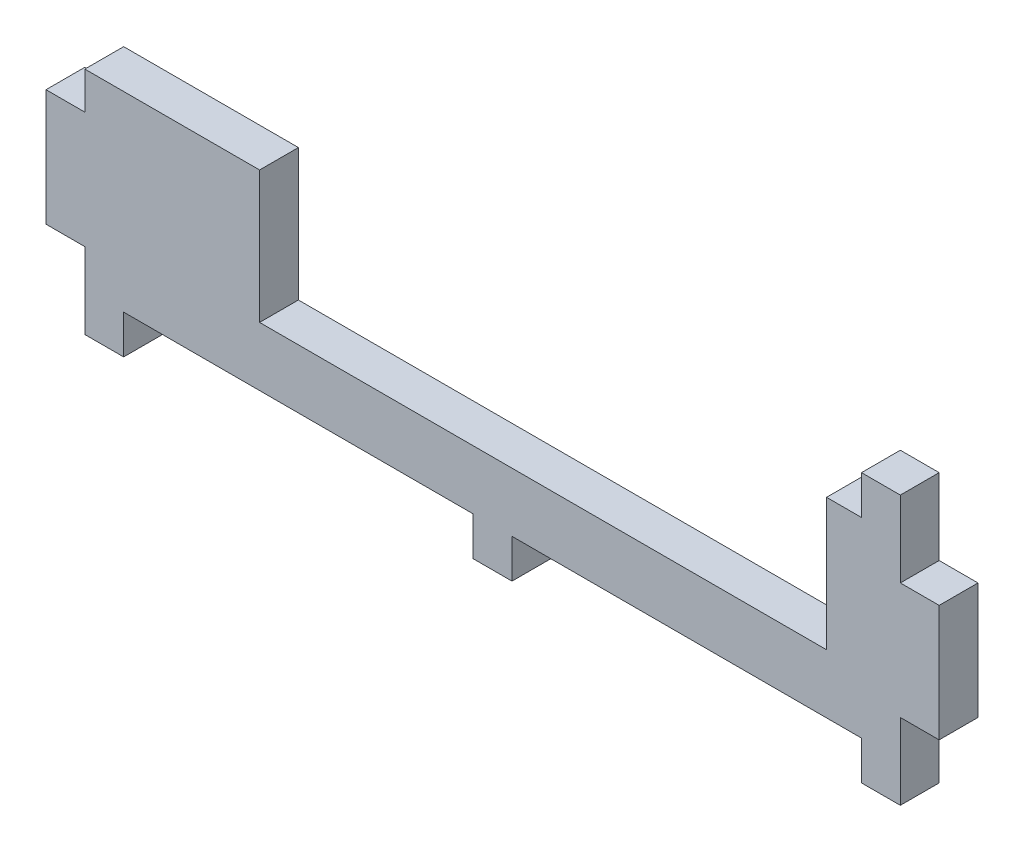
ISO-10303-21;
HEADER;
FILE_DESCRIPTION(('STEP AP214'),'2;1');
FILE_NAME('part.step','',(''),(''),'','','');
FILE_SCHEMA(('AUTOMOTIVE_DESIGN { 1 0 10303 214 1 1 1 1 }'));
ENDSEC;
DATA;
#1=APPLICATION_CONTEXT('core data for automotive mechanical design processes');
#2=APPLICATION_PROTOCOL_DEFINITION('international standard','automotive_design',2000,#1);
#3=PRODUCT_CONTEXT('',#1,'mechanical');
#4=PRODUCT('Part','Part','',(#3));
#5=PRODUCT_RELATED_PRODUCT_CATEGORY('part','',(#4));
#6=PRODUCT_DEFINITION_FORMATION('','',#4);
#7=PRODUCT_DEFINITION_CONTEXT('part definition',#1,'design');
#8=PRODUCT_DEFINITION('design','',#6,#7);
#9=PRODUCT_DEFINITION_SHAPE('','',#8);
#10=(LENGTH_UNIT() NAMED_UNIT(*) SI_UNIT(.MILLI.,.METRE.));
#11=(NAMED_UNIT(*) PLANE_ANGLE_UNIT() SI_UNIT($,.RADIAN.));
#12=(NAMED_UNIT(*) SI_UNIT($,.STERADIAN.) SOLID_ANGLE_UNIT());
#13=UNCERTAINTY_MEASURE_WITH_UNIT(LENGTH_MEASURE(1.E-05),#10,'distance_accuracy_value','');
#14=(GEOMETRIC_REPRESENTATION_CONTEXT(3) GLOBAL_UNCERTAINTY_ASSIGNED_CONTEXT((#13)) GLOBAL_UNIT_ASSIGNED_CONTEXT((#10,
#11,#12)) REPRESENTATION_CONTEXT('',''));
#15=CARTESIAN_POINT('',(0.,0.,0.));
#16=DIRECTION('',(0.,0.,1.));
#17=DIRECTION('',(1.,0.,0.));
#18=AXIS2_PLACEMENT_3D('',#15,#16,#17);
#19=CARTESIAN_POINT('',(52.5,-6.15,5.));
#20=DIRECTION('',(-1.,0.,0.));
#21=DIRECTION('',(0.,0.,1.));
#22=AXIS2_PLACEMENT_3D('',#19,#20,#21);
#23=PLANE('',#22);
#24=DIRECTION('',(0.,1.,0.));
#25=VECTOR('',#24,1.);
#26=CARTESIAN_POINT('',(52.5,-6.15,0.));
#27=LINE('',#26,#25);
#28=CARTESIAN_POINT('',(52.5,-11.15,0.));
#29=VERTEX_POINT('',#28);
#30=CARTESIAN_POINT('',(52.5,-1.35,0.));
#31=VERTEX_POINT('',#30);
#32=EDGE_CURVE('E258',#29,#31,#27,.T.);
#33=ORIENTED_EDGE('',*,*,#32,.T.);
#34=DIRECTION('',(0.,0.,1.));
#35=VECTOR('',#34,1.);
#36=CARTESIAN_POINT('',(52.5,-1.35,0.));
#37=LINE('',#36,#35);
#38=CARTESIAN_POINT('',(52.5,-1.35,5.));
#39=VERTEX_POINT('',#38);
#40=EDGE_CURVE('E226',#31,#39,#37,.T.);
#41=ORIENTED_EDGE('',*,*,#40,.T.);
#42=DIRECTION('',(0.,1.,0.));
#43=VECTOR('',#42,1.);
#44=CARTESIAN_POINT('',(52.5,-6.15,5.));
#45=LINE('',#44,#43);
#46=CARTESIAN_POINT('',(52.5,-11.15,5.));
#47=VERTEX_POINT('',#46);
#48=EDGE_CURVE('E456',#47,#39,#45,.T.);
#49=ORIENTED_EDGE('',*,*,#48,.F.);
#50=DIRECTION('',(0.,0.,1.));
#51=VECTOR('',#50,1.);
#52=CARTESIAN_POINT('',(52.5,-11.15,5.));
#53=LINE('',#52,#51);
#54=EDGE_CURVE('E266',#29,#47,#53,.T.);
#55=ORIENTED_EDGE('',*,*,#54,.F.);
#56=EDGE_LOOP('',(#33,#41,#49,#55));
#57=FACE_BOUND('',#56,.T.);
#58=ADVANCED_FACE('F33',(#57),#23,.F.);
#59=CARTESIAN_POINT('',(-52.5,-6.15,5.));
#60=DIRECTION('',(1.,0.,0.));
#61=DIRECTION('',(0.,0.,-1.));
#62=AXIS2_PLACEMENT_3D('',#59,#60,#61);
#63=PLANE('',#62);
#64=DIRECTION('',(0.,0.,-1.));
#65=VECTOR('',#64,1.);
#66=CARTESIAN_POINT('',(-52.5,13.65,0.));
#67=LINE('',#66,#65);
#68=CARTESIAN_POINT('',(-52.5,13.65,5.));
#69=VERTEX_POINT('',#68);
#70=CARTESIAN_POINT('',(-52.5,13.65,0.));
#71=VERTEX_POINT('',#70);
#72=EDGE_CURVE('E58',#69,#71,#67,.T.);
#73=ORIENTED_EDGE('',*,*,#72,.F.);
#74=DIRECTION('',(0.,-1.,0.));
#75=VECTOR('',#74,1.);
#76=CARTESIAN_POINT('',(-52.5,-6.15,5.));
#77=LINE('',#76,#75);
#78=CARTESIAN_POINT('',(-52.5,18.45,5.));
#79=VERTEX_POINT('',#78);
#80=EDGE_CURVE('E295',#79,#69,#77,.T.);
#81=ORIENTED_EDGE('',*,*,#80,.F.);
#82=DIRECTION('',(0.,0.,-1.));
#83=VECTOR('',#82,1.);
#84=CARTESIAN_POINT('',(-52.5,18.45,5.));
#85=LINE('',#84,#83);
#86=CARTESIAN_POINT('',(-52.5,18.45,0.));
#87=VERTEX_POINT('',#86);
#88=EDGE_CURVE('E316',#79,#87,#85,.T.);
#89=ORIENTED_EDGE('',*,*,#88,.T.);
#90=DIRECTION('',(0.,-1.,0.));
#91=VECTOR('',#90,1.);
#92=CARTESIAN_POINT('',(-52.5,-6.15,0.));
#93=LINE('',#92,#91);
#94=EDGE_CURVE('E269',#87,#71,#93,.T.);
#95=ORIENTED_EDGE('',*,*,#94,.T.);
#96=EDGE_LOOP('',(#73,#81,#89,#95));
#97=FACE_BOUND('',#96,.T.);
#98=ADVANCED_FACE('F452',(#97),#63,.F.);
#99=DIRECTION('',(0.,0.,1.));
#100=VECTOR('',#99,1.);
#101=CARTESIAN_POINT('',(-52.5,-1.35,0.));
#102=LINE('',#101,#100);
#103=CARTESIAN_POINT('',(-52.5,-1.35,0.));
#104=VERTEX_POINT('',#103);
#105=CARTESIAN_POINT('',(-52.5,-1.35,5.));
#106=VERTEX_POINT('',#105);
#107=EDGE_CURVE('E215',#104,#106,#102,.T.);
#108=ORIENTED_EDGE('',*,*,#107,.F.);
#109=CARTESIAN_POINT('',(-52.5,-11.15,0.));
#110=VERTEX_POINT('',#109);
#111=EDGE_CURVE('E267',#104,#110,#93,.T.);
#112=ORIENTED_EDGE('',*,*,#111,.T.);
#113=DIRECTION('',(0.,0.,-1.));
#114=VECTOR('',#113,1.);
#115=CARTESIAN_POINT('',(-52.5,-11.15,5.));
#116=LINE('',#115,#114);
#117=CARTESIAN_POINT('',(-52.5,-11.15,5.));
#118=VERTEX_POINT('',#117);
#119=EDGE_CURVE('E473',#118,#110,#116,.T.);
#120=ORIENTED_EDGE('',*,*,#119,.F.);
#121=EDGE_CURVE('E455',#106,#118,#77,.T.);
#122=ORIENTED_EDGE('',*,*,#121,.F.);
#123=EDGE_LOOP('',(#108,#112,#120,#122));
#124=FACE_BOUND('',#123,.T.);
#125=ADVANCED_FACE('F553',(#124),#63,.F.);
#126=CARTESIAN_POINT('',(-52.5,-6.15,5.));
#127=DIRECTION('',(0.,1.,0.));
#128=DIRECTION('',(0.,0.,1.));
#129=AXIS2_PLACEMENT_3D('',#126,#127,#128);
#130=PLANE('',#129);
#131=DIRECTION('',(0.,0.,1.));
#132=VECTOR('',#131,1.);
#133=CARTESIAN_POINT('',(-47.5,-6.15,5.));
#134=LINE('',#133,#132);
#135=CARTESIAN_POINT('',(-47.5,-6.15,0.));
#136=VERTEX_POINT('',#135);
#137=CARTESIAN_POINT('',(-47.5,-6.15,5.));
#138=VERTEX_POINT('',#137);
#139=EDGE_CURVE('E493',#136,#138,#134,.T.);
#140=ORIENTED_EDGE('',*,*,#139,.F.);
#141=DIRECTION('',(1.,0.,0.));
#142=VECTOR('',#141,1.);
#143=CARTESIAN_POINT('',(-52.5,-6.15,0.));
#144=LINE('',#143,#142);
#145=CARTESIAN_POINT('',(-2.5,-6.15,0.));
#146=VERTEX_POINT('',#145);
#147=EDGE_CURVE('E292',#136,#146,#144,.T.);
#148=ORIENTED_EDGE('',*,*,#147,.T.);
#149=DIRECTION('',(0.,0.,-1.));
#150=VECTOR('',#149,1.);
#151=CARTESIAN_POINT('',(-2.5,-6.15,5.));
#152=LINE('',#151,#150);
#153=CARTESIAN_POINT('',(-2.5,-6.15,5.));
#154=VERTEX_POINT('',#153);
#155=EDGE_CURVE('E370',#154,#146,#152,.T.);
#156=ORIENTED_EDGE('',*,*,#155,.F.);
#157=DIRECTION('',(1.,0.,0.));
#158=VECTOR('',#157,1.);
#159=CARTESIAN_POINT('',(-52.5,-6.15,5.));
#160=LINE('',#159,#158);
#161=EDGE_CURVE('E11',#138,#154,#160,.T.);
#162=ORIENTED_EDGE('',*,*,#161,.F.);
#163=EDGE_LOOP('',(#140,#148,#156,#162));
#164=FACE_BOUND('',#163,.T.);
#165=ADVANCED_FACE('F532',(#164),#130,.F.);
#166=DIRECTION('',(0.,0.,1.));
#167=VECTOR('',#166,1.);
#168=CARTESIAN_POINT('',(2.5,-6.15,5.));
#169=LINE('',#168,#167);
#170=CARTESIAN_POINT('',(2.50000000000001,-6.15,0.));
#171=VERTEX_POINT('',#170);
#172=CARTESIAN_POINT('',(2.50000000000001,-6.15,5.));
#173=VERTEX_POINT('',#172);
#174=EDGE_CURVE('E364',#171,#173,#169,.T.);
#175=ORIENTED_EDGE('',*,*,#174,.F.);
#176=CARTESIAN_POINT('',(47.5,-6.15,0.));
#177=VERTEX_POINT('',#176);
#178=EDGE_CURVE('E290',#171,#177,#144,.T.);
#179=ORIENTED_EDGE('',*,*,#178,.T.);
#180=DIRECTION('',(0.,0.,-1.));
#181=VECTOR('',#180,1.);
#182=CARTESIAN_POINT('',(47.5,-6.15,5.));
#183=LINE('',#182,#181);
#184=CARTESIAN_POINT('',(47.5,-6.15,5.));
#185=VERTEX_POINT('',#184);
#186=EDGE_CURVE('E337',#185,#177,#183,.T.);
#187=ORIENTED_EDGE('',*,*,#186,.F.);
#188=EDGE_CURVE('E42',#173,#185,#160,.T.);
#189=ORIENTED_EDGE('',*,*,#188,.F.);
#190=EDGE_LOOP('',(#175,#179,#187,#189));
#191=FACE_BOUND('',#190,.T.);
#192=ADVANCED_FACE('F362',(#191),#130,.F.);
#193=CARTESIAN_POINT('',(-52.5,18.45,5.));
#194=DIRECTION('',(0.,-1.,0.));
#195=DIRECTION('',(0.,0.,1.));
#196=AXIS2_PLACEMENT_3D('',#193,#194,#195);
#197=PLANE('',#196);
#198=DIRECTION('',(1.,0.,0.));
#199=VECTOR('',#198,1.);
#200=CARTESIAN_POINT('',(-52.5,18.45,5.));
#201=LINE('',#200,#199);
#202=CARTESIAN_POINT('',(-30.,18.45,5.));
#203=VERTEX_POINT('',#202);
#204=EDGE_CURVE('E300',#79,#203,#201,.T.);
#205=ORIENTED_EDGE('',*,*,#204,.T.);
#206=DIRECTION('',(0.,0.,1.));
#207=VECTOR('',#206,1.);
#208=CARTESIAN_POINT('',(-30.,18.45,0.));
#209=LINE('',#208,#207);
#210=CARTESIAN_POINT('',(-30.,18.45,0.));
#211=VERTEX_POINT('',#210);
#212=EDGE_CURVE('E380',#211,#203,#209,.T.);
#213=ORIENTED_EDGE('',*,*,#212,.F.);
#214=DIRECTION('',(1.,0.,0.));
#215=VECTOR('',#214,1.);
#216=CARTESIAN_POINT('',(-52.5,18.45,0.));
#217=LINE('',#216,#215);
#218=EDGE_CURVE('E301',#87,#211,#217,.T.);
#219=ORIENTED_EDGE('',*,*,#218,.F.);
#220=ORIENTED_EDGE('',*,*,#88,.F.);
#221=EDGE_LOOP('',(#205,#213,#219,#220));
#222=FACE_BOUND('',#221,.T.);
#223=ADVANCED_FACE('F448',(#222),#197,.F.);
#224=CARTESIAN_POINT('',(52.5,13.65,5.));
#225=VERTEX_POINT('',#224);
#226=CARTESIAN_POINT('',(52.5,23.45,5.));
#227=VERTEX_POINT('',#226);
#228=EDGE_CURVE('E242',#225,#227,#45,.T.);
#229=ORIENTED_EDGE('',*,*,#228,.F.);
#230=DIRECTION('',(0.,0.,-1.));
#231=VECTOR('',#230,1.);
#232=CARTESIAN_POINT('',(52.5,13.65,0.));
#233=LINE('',#232,#231);
#234=CARTESIAN_POINT('',(52.5,13.65,0.));
#235=VERTEX_POINT('',#234);
#236=EDGE_CURVE('E240',#225,#235,#233,.T.);
#237=ORIENTED_EDGE('',*,*,#236,.T.);
#238=CARTESIAN_POINT('',(52.5,23.45,0.));
#239=VERTEX_POINT('',#238);
#240=EDGE_CURVE('E214',#235,#239,#27,.T.);
#241=ORIENTED_EDGE('',*,*,#240,.T.);
#242=DIRECTION('',(0.,0.,1.));
#243=VECTOR('',#242,1.);
#244=CARTESIAN_POINT('',(52.5,23.45,5.));
#245=LINE('',#244,#243);
#246=EDGE_CURVE('E413',#239,#227,#245,.T.);
#247=ORIENTED_EDGE('',*,*,#246,.T.);
#248=EDGE_LOOP('',(#229,#237,#241,#247));
#249=FACE_BOUND('',#248,.T.);
#250=ADVANCED_FACE('F35',(#249),#23,.F.);
#251=CARTESIAN_POINT('',(0.,0.,5.));
#252=DIRECTION('',(0.,0.,-1.));
#253=DIRECTION('',(-1.,0.,0.));
#254=AXIS2_PLACEMENT_3D('',#251,#252,#253);
#255=PLANE('',#254);
#256=DIRECTION('',(1.,0.,0.));
#257=VECTOR('',#256,1.);
#258=CARTESIAN_POINT('',(-30.,1.45,5.));
#259=LINE('',#258,#257);
#260=CARTESIAN_POINT('',(-30.,1.45,5.));
#261=VERTEX_POINT('',#260);
#262=CARTESIAN_POINT('',(43.,1.45,5.));
#263=VERTEX_POINT('',#262);
#264=EDGE_CURVE('E389',#261,#263,#259,.T.);
#265=ORIENTED_EDGE('',*,*,#264,.F.);
#266=DIRECTION('',(0.,1.,0.));
#267=VECTOR('',#266,1.);
#268=CARTESIAN_POINT('',(-30.,1.45,5.));
#269=LINE('',#268,#267);
#270=EDGE_CURVE('E399',#261,#203,#269,.T.);
#271=ORIENTED_EDGE('',*,*,#270,.T.);
#272=ORIENTED_EDGE('',*,*,#204,.F.);
#273=ORIENTED_EDGE('',*,*,#80,.T.);
#274=DIRECTION('',(1.,0.,0.));
#275=VECTOR('',#274,1.);
#276=CARTESIAN_POINT('',(-57.5,13.65,5.));
#277=LINE('',#276,#275);
#278=CARTESIAN_POINT('',(-57.5,13.65,5.));
#279=VERTEX_POINT('',#278);
#280=EDGE_CURVE('E484',#279,#69,#277,.T.);
#281=ORIENTED_EDGE('',*,*,#280,.F.);
#282=DIRECTION('',(0.,1.,0.));
#283=VECTOR('',#282,1.);
#284=CARTESIAN_POINT('',(-57.5,13.65,5.));
#285=LINE('',#284,#283);
#286=CARTESIAN_POINT('',(-57.5,-1.35,5.));
#287=VERTEX_POINT('',#286);
#288=EDGE_CURVE('E848',#287,#279,#285,.T.);
#289=ORIENTED_EDGE('',*,*,#288,.F.);
#290=DIRECTION('',(1.,0.,0.));
#291=VECTOR('',#290,1.);
#292=CARTESIAN_POINT('',(-57.5,-1.35,5.));
#293=LINE('',#292,#291);
#294=EDGE_CURVE('E464',#287,#106,#293,.T.);
#295=ORIENTED_EDGE('',*,*,#294,.T.);
#296=ORIENTED_EDGE('',*,*,#121,.T.);
#297=DIRECTION('',(-1.,0.,0.));
#298=VECTOR('',#297,1.);
#299=CARTESIAN_POINT('',(-52.5,-11.15,5.));
#300=LINE('',#299,#298);
#301=CARTESIAN_POINT('',(-47.5,-11.15,5.));
#302=VERTEX_POINT('',#301);
#303=EDGE_CURVE('E508',#302,#118,#300,.T.);
#304=ORIENTED_EDGE('',*,*,#303,.F.);
#305=DIRECTION('',(0.,1.,0.));
#306=VECTOR('',#305,1.);
#307=CARTESIAN_POINT('',(-47.5,-11.15,5.));
#308=LINE('',#307,#306);
#309=EDGE_CURVE('E510',#302,#138,#308,.T.);
#310=ORIENTED_EDGE('',*,*,#309,.T.);
#311=ORIENTED_EDGE('',*,*,#161,.T.);
#312=DIRECTION('',(0.,1.,0.));
#313=VECTOR('',#312,1.);
#314=CARTESIAN_POINT('',(-2.5,-11.15,5.));
#315=LINE('',#314,#313);
#316=CARTESIAN_POINT('',(-2.5,-11.15,5.));
#317=VERTEX_POINT('',#316);
#318=EDGE_CURVE('E382',#317,#154,#315,.T.);
#319=ORIENTED_EDGE('',*,*,#318,.F.);
#320=DIRECTION('',(-1.,0.,0.));
#321=VECTOR('',#320,1.);
#322=CARTESIAN_POINT('',(-2.5,-11.15,5.));
#323=LINE('',#322,#321);
#324=CARTESIAN_POINT('',(2.5,-11.15,5.));
#325=VERTEX_POINT('',#324);
#326=EDGE_CURVE('E519',#325,#317,#323,.T.);
#327=ORIENTED_EDGE('',*,*,#326,.F.);
#328=DIRECTION('',(0.,1.,0.));
#329=VECTOR('',#328,1.);
#330=CARTESIAN_POINT('',(2.5,-11.15,5.));
#331=LINE('',#330,#329);
#332=EDGE_CURVE('E377',#325,#173,#331,.T.);
#333=ORIENTED_EDGE('',*,*,#332,.T.);
#334=ORIENTED_EDGE('',*,*,#188,.T.);
#335=DIRECTION('',(0.,1.,0.));
#336=VECTOR('',#335,1.);
#337=CARTESIAN_POINT('',(47.5,-11.15,5.));
#338=LINE('',#337,#336);
#339=CARTESIAN_POINT('',(47.5,-11.15,5.));
#340=VERTEX_POINT('',#339);
#341=EDGE_CURVE('E342',#340,#185,#338,.T.);
#342=ORIENTED_EDGE('',*,*,#341,.F.);
#343=DIRECTION('',(-1.,0.,0.));
#344=VECTOR('',#343,1.);
#345=CARTESIAN_POINT('',(47.5,-11.15,5.));
#346=LINE('',#345,#344);
#347=EDGE_CURVE('E340',#47,#340,#346,.T.);
#348=ORIENTED_EDGE('',*,*,#347,.F.);
#349=ORIENTED_EDGE('',*,*,#48,.T.);
#350=DIRECTION('',(-1.,0.,0.));
#351=VECTOR('',#350,1.);
#352=CARTESIAN_POINT('',(57.5,-1.35,5.));
#353=LINE('',#352,#351);
#354=CARTESIAN_POINT('',(57.5,-1.35,5.));
#355=VERTEX_POINT('',#354);
#356=EDGE_CURVE('E249',#355,#39,#353,.T.);
#357=ORIENTED_EDGE('',*,*,#356,.F.);
#358=DIRECTION('',(0.,1.,0.));
#359=VECTOR('',#358,1.);
#360=CARTESIAN_POINT('',(57.5,13.65,5.));
#361=LINE('',#360,#359);
#362=CARTESIAN_POINT('',(57.5,13.65,5.));
#363=VERTEX_POINT('',#362);
#364=EDGE_CURVE('E229',#355,#363,#361,.T.);
#365=ORIENTED_EDGE('',*,*,#364,.T.);
#366=DIRECTION('',(-1.,0.,0.));
#367=VECTOR('',#366,1.);
#368=CARTESIAN_POINT('',(57.5,13.65,5.));
#369=LINE('',#368,#367);
#370=EDGE_CURVE('E216',#363,#225,#369,.T.);
#371=ORIENTED_EDGE('',*,*,#370,.T.);
#372=ORIENTED_EDGE('',*,*,#228,.T.);
#373=DIRECTION('',(-1.,0.,0.));
#374=VECTOR('',#373,1.);
#375=CARTESIAN_POINT('',(47.5,23.45,5.));
#376=LINE('',#375,#374);
#377=CARTESIAN_POINT('',(47.5,23.45,5.));
#378=VERTEX_POINT('',#377);
#379=EDGE_CURVE('E330',#227,#378,#376,.T.);
#380=ORIENTED_EDGE('',*,*,#379,.T.);
#381=DIRECTION('',(0.,-1.,0.));
#382=VECTOR('',#381,1.);
#383=CARTESIAN_POINT('',(47.5,23.45,5.));
#384=LINE('',#383,#382);
#385=CARTESIAN_POINT('',(47.5,18.45,5.));
#386=VERTEX_POINT('',#385);
#387=EDGE_CURVE('E320',#378,#386,#384,.T.);
#388=ORIENTED_EDGE('',*,*,#387,.T.);
#389=CARTESIAN_POINT('',(43.,18.45,5.));
#390=VERTEX_POINT('',#389);
#391=EDGE_CURVE('E297',#390,#386,#201,.T.);
#392=ORIENTED_EDGE('',*,*,#391,.F.);
#393=DIRECTION('',(0.,1.,0.));
#394=VECTOR('',#393,1.);
#395=CARTESIAN_POINT('',(43.,1.45,5.));
#396=LINE('',#395,#394);
#397=EDGE_CURVE('E406',#263,#390,#396,.T.);
#398=ORIENTED_EDGE('',*,*,#397,.F.);
#399=EDGE_LOOP('',(#265,#271,#272,#273,#281,#289,#295,#296,#304,#310,#311,#319,#327,#333,#334,
#342,#348,#349,#357,#365,#371,#372,#380,#388,#392,#398));
#400=FACE_BOUND('',#399,.T.);
#401=ADVANCED_FACE('F419',(#400),#255,.F.);
#402=CARTESIAN_POINT('',(0.,0.,0.));
#403=DIRECTION('',(0.,0.,-1.));
#404=DIRECTION('',(-1.,0.,0.));
#405=AXIS2_PLACEMENT_3D('',#402,#403,#404);
#406=PLANE('',#405);
#407=DIRECTION('',(0.,1.,0.));
#408=VECTOR('',#407,1.);
#409=CARTESIAN_POINT('',(-30.,1.45,0.));
#410=LINE('',#409,#408);
#411=CARTESIAN_POINT('',(-30.,1.45,0.));
#412=VERTEX_POINT('',#411);
#413=EDGE_CURVE('E327',#412,#211,#410,.T.);
#414=ORIENTED_EDGE('',*,*,#413,.F.);
#415=DIRECTION('',(-1.,0.,0.));
#416=VECTOR('',#415,1.);
#417=CARTESIAN_POINT('',(-30.,1.45,0.));
#418=LINE('',#417,#416);
#419=CARTESIAN_POINT('',(43.,1.45,0.));
#420=VERTEX_POINT('',#419);
#421=EDGE_CURVE('E396',#420,#412,#418,.T.);
#422=ORIENTED_EDGE('',*,*,#421,.F.);
#423=DIRECTION('',(0.,1.,0.));
#424=VECTOR('',#423,1.);
#425=CARTESIAN_POINT('',(43.,1.45,0.));
#426=LINE('',#425,#424);
#427=CARTESIAN_POINT('',(43.,18.45,0.));
#428=VERTEX_POINT('',#427);
#429=EDGE_CURVE('E403',#420,#428,#426,.T.);
#430=ORIENTED_EDGE('',*,*,#429,.T.);
#431=CARTESIAN_POINT('',(47.5,18.45,0.));
#432=VERTEX_POINT('',#431);
#433=EDGE_CURVE('E302',#428,#432,#217,.T.);
#434=ORIENTED_EDGE('',*,*,#433,.T.);
#435=DIRECTION('',(0.,-1.,0.));
#436=VECTOR('',#435,1.);
#437=CARTESIAN_POINT('',(47.5,23.45,0.));
#438=LINE('',#437,#436);
#439=CARTESIAN_POINT('',(47.5,23.45,0.));
#440=VERTEX_POINT('',#439);
#441=EDGE_CURVE('E317',#440,#432,#438,.T.);
#442=ORIENTED_EDGE('',*,*,#441,.F.);
#443=DIRECTION('',(1.,0.,0.));
#444=VECTOR('',#443,1.);
#445=CARTESIAN_POINT('',(47.5,23.45,0.));
#446=LINE('',#445,#444);
#447=EDGE_CURVE('E411',#440,#239,#446,.T.);
#448=ORIENTED_EDGE('',*,*,#447,.T.);
#449=ORIENTED_EDGE('',*,*,#240,.F.);
#450=DIRECTION('',(-1.,0.,0.));
#451=VECTOR('',#450,1.);
#452=CARTESIAN_POINT('',(57.5,13.65,0.));
#453=LINE('',#452,#451);
#454=CARTESIAN_POINT('',(57.5,13.65,0.));
#455=VERTEX_POINT('',#454);
#456=EDGE_CURVE('E50',#455,#235,#453,.T.);
#457=ORIENTED_EDGE('',*,*,#456,.F.);
#458=DIRECTION('',(0.,-1.,0.));
#459=VECTOR('',#458,1.);
#460=CARTESIAN_POINT('',(57.5,13.65,0.));
#461=LINE('',#460,#459);
#462=CARTESIAN_POINT('',(57.5,-1.35,0.));
#463=VERTEX_POINT('',#462);
#464=EDGE_CURVE('E211',#455,#463,#461,.T.);
#465=ORIENTED_EDGE('',*,*,#464,.T.);
#466=DIRECTION('',(-1.,0.,0.));
#467=VECTOR('',#466,1.);
#468=CARTESIAN_POINT('',(57.5,-1.35,0.));
#469=LINE('',#468,#467);
#470=EDGE_CURVE('E234',#463,#31,#469,.T.);
#471=ORIENTED_EDGE('',*,*,#470,.T.);
#472=ORIENTED_EDGE('',*,*,#32,.F.);
#473=DIRECTION('',(1.,0.,0.));
#474=VECTOR('',#473,1.);
#475=CARTESIAN_POINT('',(47.5,-11.15,0.));
#476=LINE('',#475,#474);
#477=CARTESIAN_POINT('',(47.5,-11.15,0.));
#478=VERTEX_POINT('',#477);
#479=EDGE_CURVE('E336',#478,#29,#476,.T.);
#480=ORIENTED_EDGE('',*,*,#479,.F.);
#481=DIRECTION('',(0.,1.,0.));
#482=VECTOR('',#481,1.);
#483=CARTESIAN_POINT('',(47.5,-11.15,0.));
#484=LINE('',#483,#482);
#485=EDGE_CURVE('E271',#478,#177,#484,.T.);
#486=ORIENTED_EDGE('',*,*,#485,.T.);
#487=ORIENTED_EDGE('',*,*,#178,.F.);
#488=DIRECTION('',(0.,1.,0.));
#489=VECTOR('',#488,1.);
#490=CARTESIAN_POINT('',(2.50000000000001,-11.15,0.));
#491=LINE('',#490,#489);
#492=CARTESIAN_POINT('',(2.50000000000001,-11.15,0.));
#493=VERTEX_POINT('',#492);
#494=EDGE_CURVE('E373',#493,#171,#491,.T.);
#495=ORIENTED_EDGE('',*,*,#494,.F.);
#496=DIRECTION('',(1.,0.,0.));
#497=VECTOR('',#496,1.);
#498=CARTESIAN_POINT('',(-2.5,-11.15,0.));
#499=LINE('',#498,#497);
#500=CARTESIAN_POINT('',(-2.5,-11.15,0.));
#501=VERTEX_POINT('',#500);
#502=EDGE_CURVE('E516',#501,#493,#499,.T.);
#503=ORIENTED_EDGE('',*,*,#502,.F.);
#504=DIRECTION('',(0.,1.,0.));
#505=VECTOR('',#504,1.);
#506=CARTESIAN_POINT('',(-2.5,-11.15,0.));
#507=LINE('',#506,#505);
#508=EDGE_CURVE('E376',#501,#146,#507,.T.);
#509=ORIENTED_EDGE('',*,*,#508,.T.);
#510=ORIENTED_EDGE('',*,*,#147,.F.);
#511=DIRECTION('',(0.,1.,0.));
#512=VECTOR('',#511,1.);
#513=CARTESIAN_POINT('',(-47.5,-11.15,0.));
#514=LINE('',#513,#512);
#515=CARTESIAN_POINT('',(-47.5,-11.15,0.));
#516=VERTEX_POINT('',#515);
#517=EDGE_CURVE('E512',#516,#136,#514,.T.);
#518=ORIENTED_EDGE('',*,*,#517,.F.);
#519=DIRECTION('',(1.,0.,0.));
#520=VECTOR('',#519,1.);
#521=CARTESIAN_POINT('',(-52.5,-11.15,0.));
#522=LINE('',#521,#520);
#523=EDGE_CURVE('E505',#110,#516,#522,.T.);
#524=ORIENTED_EDGE('',*,*,#523,.F.);
#525=ORIENTED_EDGE('',*,*,#111,.F.);
#526=DIRECTION('',(1.,0.,0.));
#527=VECTOR('',#526,1.);
#528=CARTESIAN_POINT('',(-57.5,-1.35,0.));
#529=LINE('',#528,#527);
#530=CARTESIAN_POINT('',(-57.5,-1.35,0.));
#531=VERTEX_POINT('',#530);
#532=EDGE_CURVE('E489',#531,#104,#529,.T.);
#533=ORIENTED_EDGE('',*,*,#532,.F.);
#534=DIRECTION('',(0.,-1.,0.));
#535=VECTOR('',#534,1.);
#536=CARTESIAN_POINT('',(-57.5,13.65,0.));
#537=LINE('',#536,#535);
#538=CARTESIAN_POINT('',(-57.5,13.65,0.));
#539=VERTEX_POINT('',#538);
#540=EDGE_CURVE('E478',#539,#531,#537,.T.);
#541=ORIENTED_EDGE('',*,*,#540,.F.);
#542=DIRECTION('',(1.,0.,0.));
#543=VECTOR('',#542,1.);
#544=CARTESIAN_POINT('',(-57.5,13.65,0.));
#545=LINE('',#544,#543);
#546=EDGE_CURVE('E481',#539,#71,#545,.T.);
#547=ORIENTED_EDGE('',*,*,#546,.T.);
#548=ORIENTED_EDGE('',*,*,#94,.F.);
#549=ORIENTED_EDGE('',*,*,#218,.T.);
#550=EDGE_LOOP('',(#414,#422,#430,#434,#442,#448,#449,#457,#465,#471,#472,#480,#486,#487,#495,
#503,#509,#510,#518,#524,#525,#533,#541,#547,#548,#549));
#551=FACE_BOUND('',#550,.T.);
#552=ADVANCED_FACE('F210',(#551),#406,.T.);
#553=CARTESIAN_POINT('',(47.5,-11.15,5.));
#554=DIRECTION('',(1.,0.,0.));
#555=DIRECTION('',(0.,0.,-1.));
#556=AXIS2_PLACEMENT_3D('',#553,#554,#555);
#557=PLANE('',#556);
#558=ORIENTED_EDGE('',*,*,#186,.T.);
#559=ORIENTED_EDGE('',*,*,#485,.F.);
#560=DIRECTION('',(0.,0.,-1.));
#561=VECTOR('',#560,1.);
#562=CARTESIAN_POINT('',(47.5,-11.15,5.));
#563=LINE('',#562,#561);
#564=EDGE_CURVE('E333',#340,#478,#563,.T.);
#565=ORIENTED_EDGE('',*,*,#564,.F.);
#566=ORIENTED_EDGE('',*,*,#341,.T.);
#567=EDGE_LOOP('',(#558,#559,#565,#566));
#568=FACE_BOUND('',#567,.T.);
#569=ADVANCED_FACE('F360',(#568),#557,.F.);
#570=CARTESIAN_POINT('',(0.,-11.15,0.));
#571=DIRECTION('',(0.,-1.,0.));
#572=DIRECTION('',(0.,0.,-1.));
#573=AXIS2_PLACEMENT_3D('',#570,#571,#572);
#574=PLANE('',#573);
#575=ORIENTED_EDGE('',*,*,#564,.T.);
#576=ORIENTED_EDGE('',*,*,#479,.T.);
#577=ORIENTED_EDGE('',*,*,#54,.T.);
#578=ORIENTED_EDGE('',*,*,#347,.T.);
#579=EDGE_LOOP('',(#575,#576,#577,#578));
#580=FACE_BOUND('',#579,.T.);
#581=ADVANCED_FACE('F538',(#580),#574,.T.);
#582=ORIENTED_EDGE('',*,*,#433,.F.);
#583=DIRECTION('',(0.,0.,-1.));
#584=VECTOR('',#583,1.);
#585=CARTESIAN_POINT('',(43.,18.45,0.));
#586=LINE('',#585,#584);
#587=EDGE_CURVE('E390',#390,#428,#586,.T.);
#588=ORIENTED_EDGE('',*,*,#587,.F.);
#589=ORIENTED_EDGE('',*,*,#391,.T.);
#590=DIRECTION('',(0.,0.,-1.));
#591=VECTOR('',#590,1.);
#592=CARTESIAN_POINT('',(47.5,18.45,5.));
#593=LINE('',#592,#591);
#594=EDGE_CURVE('E323',#386,#432,#593,.T.);
#595=ORIENTED_EDGE('',*,*,#594,.T.);
#596=EDGE_LOOP('',(#582,#588,#589,#595));
#597=FACE_BOUND('',#596,.T.);
#598=ADVANCED_FACE('F434',(#597),#197,.F.);
#599=CARTESIAN_POINT('',(47.5,23.45,5.));
#600=DIRECTION('',(1.,0.,0.));
#601=DIRECTION('',(0.,0.,-1.));
#602=AXIS2_PLACEMENT_3D('',#599,#600,#601);
#603=PLANE('',#602);
#604=ORIENTED_EDGE('',*,*,#594,.F.);
#605=ORIENTED_EDGE('',*,*,#387,.F.);
#606=DIRECTION('',(0.,0.,-1.));
#607=VECTOR('',#606,1.);
#608=CARTESIAN_POINT('',(47.5,23.45,5.));
#609=LINE('',#608,#607);
#610=EDGE_CURVE('E326',#378,#440,#609,.T.);
#611=ORIENTED_EDGE('',*,*,#610,.T.);
#612=ORIENTED_EDGE('',*,*,#441,.T.);
#613=EDGE_LOOP('',(#604,#605,#611,#612));
#614=FACE_BOUND('',#613,.T.);
#615=ADVANCED_FACE('F432',(#614),#603,.F.);
#616=CARTESIAN_POINT('',(0.,23.45,0.));
#617=DIRECTION('',(0.,1.,0.));
#618=DIRECTION('',(0.,0.,-1.));
#619=AXIS2_PLACEMENT_3D('',#616,#617,#618);
#620=PLANE('',#619);
#621=ORIENTED_EDGE('',*,*,#610,.F.);
#622=ORIENTED_EDGE('',*,*,#379,.F.);
#623=ORIENTED_EDGE('',*,*,#246,.F.);
#624=ORIENTED_EDGE('',*,*,#447,.F.);
#625=EDGE_LOOP('',(#621,#622,#623,#624));
#626=FACE_BOUND('',#625,.T.);
#627=ADVANCED_FACE('F426',(#626),#620,.T.);
#628=CARTESIAN_POINT('',(-30.,1.45,0.));
#629=DIRECTION('',(-1.,0.,0.));
#630=DIRECTION('',(0.,0.,1.));
#631=AXIS2_PLACEMENT_3D('',#628,#629,#630);
#632=PLANE('',#631);
#633=ORIENTED_EDGE('',*,*,#212,.T.);
#634=ORIENTED_EDGE('',*,*,#270,.F.);
#635=DIRECTION('',(0.,0.,1.));
#636=VECTOR('',#635,1.);
#637=CARTESIAN_POINT('',(-30.,1.45,0.));
#638=LINE('',#637,#636);
#639=EDGE_CURVE('E386',#412,#261,#638,.T.);
#640=ORIENTED_EDGE('',*,*,#639,.F.);
#641=ORIENTED_EDGE('',*,*,#413,.T.);
#642=EDGE_LOOP('',(#633,#634,#640,#641));
#643=FACE_BOUND('',#642,.T.);
#644=ADVANCED_FACE('F443',(#643),#632,.F.);
#645=CARTESIAN_POINT('',(43.,1.45,0.));
#646=DIRECTION('',(1.,0.,0.));
#647=DIRECTION('',(0.,0.,-1.));
#648=AXIS2_PLACEMENT_3D('',#645,#646,#647);
#649=PLANE('',#648);
#650=ORIENTED_EDGE('',*,*,#587,.T.);
#651=ORIENTED_EDGE('',*,*,#429,.F.);
#652=DIRECTION('',(0.,0.,-1.));
#653=VECTOR('',#652,1.);
#654=CARTESIAN_POINT('',(43.,1.45,0.));
#655=LINE('',#654,#653);
#656=EDGE_CURVE('E393',#263,#420,#655,.T.);
#657=ORIENTED_EDGE('',*,*,#656,.F.);
#658=ORIENTED_EDGE('',*,*,#397,.T.);
#659=EDGE_LOOP('',(#650,#651,#657,#658));
#660=FACE_BOUND('',#659,.T.);
#661=ADVANCED_FACE('F438',(#660),#649,.F.);
#662=CARTESIAN_POINT('',(0.,1.45,0.));
#663=DIRECTION('',(0.,1.,0.));
#664=DIRECTION('',(0.,0.,1.));
#665=AXIS2_PLACEMENT_3D('',#662,#663,#664);
#666=PLANE('',#665);
#667=ORIENTED_EDGE('',*,*,#639,.T.);
#668=ORIENTED_EDGE('',*,*,#264,.T.);
#669=ORIENTED_EDGE('',*,*,#656,.T.);
#670=ORIENTED_EDGE('',*,*,#421,.T.);
#671=EDGE_LOOP('',(#667,#668,#669,#670));
#672=FACE_BOUND('',#671,.T.);
#673=ADVANCED_FACE('F441',(#672),#666,.T.);
#674=CARTESIAN_POINT('',(-2.5,-11.15,5.));
#675=DIRECTION('',(1.,0.,0.));
#676=DIRECTION('',(0.,0.,-1.));
#677=AXIS2_PLACEMENT_3D('',#674,#675,#676);
#678=PLANE('',#677);
#679=ORIENTED_EDGE('',*,*,#155,.T.);
#680=ORIENTED_EDGE('',*,*,#508,.F.);
#681=DIRECTION('',(0.,0.,-1.));
#682=VECTOR('',#681,1.);
#683=CARTESIAN_POINT('',(-2.5,-11.15,5.));
#684=LINE('',#683,#682);
#685=EDGE_CURVE('E369',#317,#501,#684,.T.);
#686=ORIENTED_EDGE('',*,*,#685,.F.);
#687=ORIENTED_EDGE('',*,*,#318,.T.);
#688=EDGE_LOOP('',(#679,#680,#686,#687));
#689=FACE_BOUND('',#688,.T.);
#690=ADVANCED_FACE('F526',(#689),#678,.F.);
#691=CARTESIAN_POINT('',(2.5,-11.15,5.));
#692=DIRECTION('',(-1.,0.,0.));
#693=DIRECTION('',(0.,0.,1.));
#694=AXIS2_PLACEMENT_3D('',#691,#692,#693);
#695=PLANE('',#694);
#696=ORIENTED_EDGE('',*,*,#174,.T.);
#697=ORIENTED_EDGE('',*,*,#332,.F.);
#698=DIRECTION('',(0.,0.,1.));
#699=VECTOR('',#698,1.);
#700=CARTESIAN_POINT('',(2.5,-11.15,5.));
#701=LINE('',#700,#699);
#702=EDGE_CURVE('E375',#493,#325,#701,.T.);
#703=ORIENTED_EDGE('',*,*,#702,.F.);
#704=ORIENTED_EDGE('',*,*,#494,.T.);
#705=EDGE_LOOP('',(#696,#697,#703,#704));
#706=FACE_BOUND('',#705,.T.);
#707=ADVANCED_FACE('F374',(#706),#695,.F.);
#708=CARTESIAN_POINT('',(0.,-11.15,0.));
#709=DIRECTION('',(0.,-1.,0.));
#710=DIRECTION('',(0.,0.,-1.));
#711=AXIS2_PLACEMENT_3D('',#708,#709,#710);
#712=PLANE('',#711);
#713=ORIENTED_EDGE('',*,*,#685,.T.);
#714=ORIENTED_EDGE('',*,*,#502,.T.);
#715=ORIENTED_EDGE('',*,*,#702,.T.);
#716=ORIENTED_EDGE('',*,*,#326,.T.);
#717=EDGE_LOOP('',(#713,#714,#715,#716));
#718=FACE_BOUND('',#717,.T.);
#719=ADVANCED_FACE('F535',(#718),#712,.T.);
#720=CARTESIAN_POINT('',(-47.5,-11.15,5.));
#721=DIRECTION('',(-1.,0.,0.));
#722=DIRECTION('',(0.,0.,1.));
#723=AXIS2_PLACEMENT_3D('',#720,#721,#722);
#724=PLANE('',#723);
#725=ORIENTED_EDGE('',*,*,#139,.T.);
#726=ORIENTED_EDGE('',*,*,#309,.F.);
#727=DIRECTION('',(0.,0.,1.));
#728=VECTOR('',#727,1.);
#729=CARTESIAN_POINT('',(-47.5,-11.15,5.));
#730=LINE('',#729,#728);
#731=EDGE_CURVE('E843',#516,#302,#730,.T.);
#732=ORIENTED_EDGE('',*,*,#731,.F.);
#733=ORIENTED_EDGE('',*,*,#517,.T.);
#734=EDGE_LOOP('',(#725,#726,#732,#733));
#735=FACE_BOUND('',#734,.T.);
#736=ADVANCED_FACE('F581',(#735),#724,.F.);
#737=CARTESIAN_POINT('',(0.,-11.15,0.));
#738=DIRECTION('',(0.,-1.,0.));
#739=DIRECTION('',(0.,0.,-1.));
#740=AXIS2_PLACEMENT_3D('',#737,#738,#739);
#741=PLANE('',#740);
#742=ORIENTED_EDGE('',*,*,#119,.T.);
#743=ORIENTED_EDGE('',*,*,#523,.T.);
#744=ORIENTED_EDGE('',*,*,#731,.T.);
#745=ORIENTED_EDGE('',*,*,#303,.T.);
#746=EDGE_LOOP('',(#742,#743,#744,#745));
#747=FACE_BOUND('',#746,.T.);
#748=ADVANCED_FACE('F584',(#747),#741,.T.);
#749=CARTESIAN_POINT('',(-57.5,-1.35,0.));
#750=DIRECTION('',(0.,1.,0.));
#751=DIRECTION('',(0.,0.,1.));
#752=AXIS2_PLACEMENT_3D('',#749,#750,#751);
#753=PLANE('',#752);
#754=ORIENTED_EDGE('',*,*,#107,.T.);
#755=ORIENTED_EDGE('',*,*,#294,.F.);
#756=DIRECTION('',(0.,0.,1.));
#757=VECTOR('',#756,1.);
#758=CARTESIAN_POINT('',(-57.5,-1.35,0.));
#759=LINE('',#758,#757);
#760=EDGE_CURVE('E847',#531,#287,#759,.T.);
#761=ORIENTED_EDGE('',*,*,#760,.F.);
#762=ORIENTED_EDGE('',*,*,#532,.T.);
#763=EDGE_LOOP('',(#754,#755,#761,#762));
#764=FACE_BOUND('',#763,.T.);
#765=ADVANCED_FACE('F587',(#764),#753,.F.);
#766=CARTESIAN_POINT('',(-57.5,13.65,0.));
#767=DIRECTION('',(0.,-1.,0.));
#768=DIRECTION('',(0.,0.,-1.));
#769=AXIS2_PLACEMENT_3D('',#766,#767,#768);
#770=PLANE('',#769);
#771=ORIENTED_EDGE('',*,*,#72,.T.);
#772=ORIENTED_EDGE('',*,*,#546,.F.);
#773=DIRECTION('',(0.,0.,-1.));
#774=VECTOR('',#773,1.);
#775=CARTESIAN_POINT('',(-57.5,13.65,0.));
#776=LINE('',#775,#774);
#777=EDGE_CURVE('E469',#279,#539,#776,.T.);
#778=ORIENTED_EDGE('',*,*,#777,.F.);
#779=ORIENTED_EDGE('',*,*,#280,.T.);
#780=EDGE_LOOP('',(#771,#772,#778,#779));
#781=FACE_BOUND('',#780,.T.);
#782=ADVANCED_FACE('F591',(#781),#770,.F.);
#783=CARTESIAN_POINT('',(-57.5,0.,0.));
#784=DIRECTION('',(-1.,0.,0.));
#785=DIRECTION('',(0.,0.,1.));
#786=AXIS2_PLACEMENT_3D('',#783,#784,#785);
#787=PLANE('',#786);
#788=ORIENTED_EDGE('',*,*,#540,.T.);
#789=ORIENTED_EDGE('',*,*,#760,.T.);
#790=ORIENTED_EDGE('',*,*,#288,.T.);
#791=ORIENTED_EDGE('',*,*,#777,.T.);
#792=EDGE_LOOP('',(#788,#789,#790,#791));
#793=FACE_BOUND('',#792,.T.);
#794=ADVANCED_FACE('F594',(#793),#787,.T.);
#795=CARTESIAN_POINT('',(57.5,13.65,0.));
#796=DIRECTION('',(0.,1.,0.));
#797=DIRECTION('',(0.,0.,1.));
#798=AXIS2_PLACEMENT_3D('',#795,#796,#797);
#799=PLANE('',#798);
#800=ORIENTED_EDGE('',*,*,#236,.F.);
#801=ORIENTED_EDGE('',*,*,#370,.F.);
#802=DIRECTION('',(0.,0.,-1.));
#803=VECTOR('',#802,1.);
#804=CARTESIAN_POINT('',(57.5,13.65,0.));
#805=LINE('',#804,#803);
#806=EDGE_CURVE('E222',#363,#455,#805,.T.);
#807=ORIENTED_EDGE('',*,*,#806,.T.);
#808=ORIENTED_EDGE('',*,*,#456,.T.);
#809=EDGE_LOOP('',(#800,#801,#807,#808));
#810=FACE_BOUND('',#809,.T.);
#811=ADVANCED_FACE('F228',(#810),#799,.T.);
#812=CARTESIAN_POINT('',(57.5,-1.35,0.));
#813=DIRECTION('',(0.,-1.,0.));
#814=DIRECTION('',(0.,0.,-1.));
#815=AXIS2_PLACEMENT_3D('',#812,#813,#814);
#816=PLANE('',#815);
#817=ORIENTED_EDGE('',*,*,#40,.F.);
#818=ORIENTED_EDGE('',*,*,#470,.F.);
#819=DIRECTION('',(0.,0.,1.));
#820=VECTOR('',#819,1.);
#821=CARTESIAN_POINT('',(57.5,-1.35,0.));
#822=LINE('',#821,#820);
#823=EDGE_CURVE('E225',#463,#355,#822,.T.);
#824=ORIENTED_EDGE('',*,*,#823,.T.);
#825=ORIENTED_EDGE('',*,*,#356,.T.);
#826=EDGE_LOOP('',(#817,#818,#824,#825));
#827=FACE_BOUND('',#826,.T.);
#828=ADVANCED_FACE('F261',(#827),#816,.T.);
#829=CARTESIAN_POINT('',(57.5,0.,0.));
#830=DIRECTION('',(1.,0.,0.));
#831=DIRECTION('',(0.,0.,1.));
#832=AXIS2_PLACEMENT_3D('',#829,#830,#831);
#833=PLANE('',#832);
#834=ORIENTED_EDGE('',*,*,#464,.F.);
#835=ORIENTED_EDGE('',*,*,#806,.F.);
#836=ORIENTED_EDGE('',*,*,#364,.F.);
#837=ORIENTED_EDGE('',*,*,#823,.F.);
#838=EDGE_LOOP('',(#834,#835,#836,#837));
#839=FACE_BOUND('',#838,.T.);
#840=ADVANCED_FACE('F220',(#839),#833,.T.);
#841=CLOSED_SHELL('',(#58,#98,#125,#165,#192,#223,#250,#401,#552,#569,#581,#598,#615,#627,#644,
#661,#673,#690,#707,#719,#736,#748,#765,#782,#794,#811,#828,#840));
#842=MANIFOLD_SOLID_BREP('B2',#841);
#843=ADVANCED_BREP_SHAPE_REPRESENTATION('',(#18,#842),#14);
#844=SHAPE_DEFINITION_REPRESENTATION(#9,#843);
ENDSEC;
END-ISO-10303-21;
